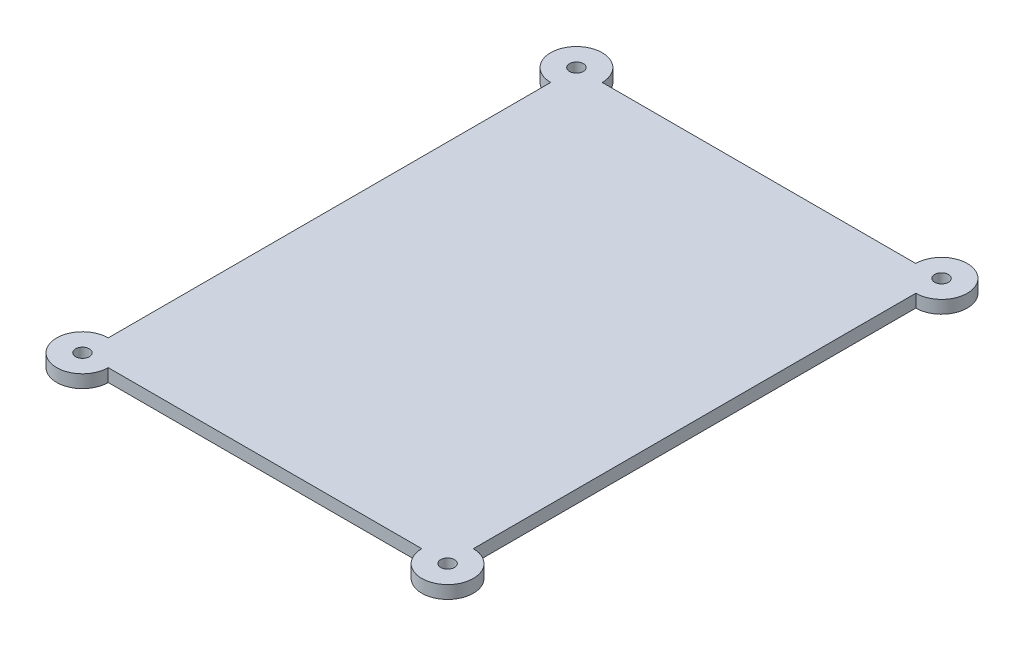
ISO-10303-21;
HEADER;
FILE_DESCRIPTION(('STEP AP214'),'2;1');
FILE_NAME('part.step','',(''),(''),'','','');
FILE_SCHEMA(('AUTOMOTIVE_DESIGN { 1 0 10303 214 1 1 1 1 }'));
ENDSEC;
DATA;
#1=APPLICATION_CONTEXT('core data for automotive mechanical design processes');
#2=APPLICATION_PROTOCOL_DEFINITION('international standard','automotive_design',2000,#1);
#3=PRODUCT_CONTEXT('',#1,'mechanical');
#4=PRODUCT('Part','Part','',(#3));
#5=PRODUCT_RELATED_PRODUCT_CATEGORY('part','',(#4));
#6=PRODUCT_DEFINITION_FORMATION('','',#4);
#7=PRODUCT_DEFINITION_CONTEXT('part definition',#1,'design');
#8=PRODUCT_DEFINITION('design','',#6,#7);
#9=PRODUCT_DEFINITION_SHAPE('','',#8);
#10=(LENGTH_UNIT() NAMED_UNIT(*) SI_UNIT(.MILLI.,.METRE.));
#11=(NAMED_UNIT(*) PLANE_ANGLE_UNIT() SI_UNIT($,.RADIAN.));
#12=(NAMED_UNIT(*) SI_UNIT($,.STERADIAN.) SOLID_ANGLE_UNIT());
#13=UNCERTAINTY_MEASURE_WITH_UNIT(LENGTH_MEASURE(1.E-05),#10,'distance_accuracy_value','');
#14=(GEOMETRIC_REPRESENTATION_CONTEXT(3) GLOBAL_UNCERTAINTY_ASSIGNED_CONTEXT((#13)) GLOBAL_UNIT_ASSIGNED_CONTEXT((#10,
#11,#12)) REPRESENTATION_CONTEXT('',''));
#15=CARTESIAN_POINT('',(0.,0.,0.));
#16=DIRECTION('',(0.,0.,1.));
#17=DIRECTION('',(1.,0.,0.));
#18=AXIS2_PLACEMENT_3D('',#15,#16,#17);
#19=CARTESIAN_POINT('',(-42.5,3.,57.5));
#20=DIRECTION('',(0.,-1.,0.));
#21=DIRECTION('',(0.,0.,-1.));
#22=AXIS2_PLACEMENT_3D('',#19,#20,#21);
#23=CYLINDRICAL_SURFACE('',#22,6.00000000000001);
#24=CARTESIAN_POINT('',(-42.5,0.,57.5));
#25=DIRECTION('',(0.,1.,0.));
#26=DIRECTION('',(0.,0.,1.));
#27=AXIS2_PLACEMENT_3D('',#24,#25,#26);
#28=CIRCLE('',#27,6.00000000000001);
#29=CARTESIAN_POINT('',(-42.5,0.,51.5));
#30=VERTEX_POINT('',#29);
#31=CARTESIAN_POINT('',(-36.5,0.,57.5));
#32=VERTEX_POINT('',#31);
#33=EDGE_CURVE('E145',#30,#32,#28,.T.);
#34=ORIENTED_EDGE('',*,*,#33,.T.);
#35=DIRECTION('',(0.,-1.,0.));
#36=VECTOR('',#35,1.);
#37=CARTESIAN_POINT('',(-36.5,3.,57.5));
#38=LINE('',#37,#36);
#39=CARTESIAN_POINT('',(-36.5,3.,57.5));
#40=VERTEX_POINT('',#39);
#41=EDGE_CURVE('E11',#40,#32,#38,.T.);
#42=ORIENTED_EDGE('',*,*,#41,.F.);
#43=CARTESIAN_POINT('',(-42.5,3.,57.5));
#44=DIRECTION('',(0.,1.,0.));
#45=DIRECTION('',(0.,0.,1.));
#46=AXIS2_PLACEMENT_3D('',#43,#44,#45);
#47=CIRCLE('',#46,6.00000000000001);
#48=CARTESIAN_POINT('',(-42.5,3.,51.5));
#49=VERTEX_POINT('',#48);
#50=EDGE_CURVE('E171',#49,#40,#47,.T.);
#51=ORIENTED_EDGE('',*,*,#50,.F.);
#52=DIRECTION('',(0.,-1.,0.));
#53=VECTOR('',#52,1.);
#54=CARTESIAN_POINT('',(-42.5,3.,51.5));
#55=LINE('',#54,#53);
#56=EDGE_CURVE('E58',#49,#30,#55,.T.);
#57=ORIENTED_EDGE('',*,*,#56,.T.);
#58=EDGE_LOOP('',(#34,#42,#51,#57));
#59=FACE_BOUND('',#58,.T.);
#60=ADVANCED_FACE('F41',(#59),#23,.T.);
#61=CARTESIAN_POINT('',(0.,3.,57.5));
#62=DIRECTION('',(0.,0.,-1.));
#63=DIRECTION('',(-1.,0.,0.));
#64=AXIS2_PLACEMENT_3D('',#61,#62,#63);
#65=PLANE('',#64);
#66=DIRECTION('',(1.,0.,0.));
#67=VECTOR('',#66,1.);
#68=CARTESIAN_POINT('',(0.,0.,57.5));
#69=LINE('',#68,#67);
#70=CARTESIAN_POINT('',(36.5,0.,57.5));
#71=VERTEX_POINT('',#70);
#72=EDGE_CURVE('E148',#32,#71,#69,.T.);
#73=ORIENTED_EDGE('',*,*,#72,.T.);
#74=DIRECTION('',(0.,-1.,0.));
#75=VECTOR('',#74,1.);
#76=CARTESIAN_POINT('',(36.5,3.,57.5));
#77=LINE('',#76,#75);
#78=CARTESIAN_POINT('',(36.5,3.,57.5));
#79=VERTEX_POINT('',#78);
#80=EDGE_CURVE('E50',#79,#71,#77,.T.);
#81=ORIENTED_EDGE('',*,*,#80,.F.);
#82=DIRECTION('',(1.,0.,0.));
#83=VECTOR('',#82,1.);
#84=CARTESIAN_POINT('',(0.,3.,57.5));
#85=LINE('',#84,#83);
#86=EDGE_CURVE('E97',#40,#79,#85,.T.);
#87=ORIENTED_EDGE('',*,*,#86,.F.);
#88=ORIENTED_EDGE('',*,*,#41,.T.);
#89=EDGE_LOOP('',(#73,#81,#87,#88));
#90=FACE_BOUND('',#89,.T.);
#91=ADVANCED_FACE('F215',(#90),#65,.F.);
#92=CARTESIAN_POINT('',(42.5,3.,57.5));
#93=DIRECTION('',(0.,-1.,0.));
#94=DIRECTION('',(0.,0.,-1.));
#95=AXIS2_PLACEMENT_3D('',#92,#93,#94);
#96=CYLINDRICAL_SURFACE('',#95,6.00000000000001);
#97=CARTESIAN_POINT('',(42.5,0.,57.5));
#98=DIRECTION('',(0.,1.,0.));
#99=DIRECTION('',(0.,0.,1.));
#100=AXIS2_PLACEMENT_3D('',#97,#98,#99);
#101=CIRCLE('',#100,6.00000000000001);
#102=CARTESIAN_POINT('',(42.5,0.,51.5));
#103=VERTEX_POINT('',#102);
#104=EDGE_CURVE('E152',#71,#103,#101,.T.);
#105=ORIENTED_EDGE('',*,*,#104,.T.);
#106=DIRECTION('',(0.,-1.,0.));
#107=VECTOR('',#106,1.);
#108=CARTESIAN_POINT('',(42.5,3.,51.5));
#109=LINE('',#108,#107);
#110=CARTESIAN_POINT('',(42.5,3.,51.5));
#111=VERTEX_POINT('',#110);
#112=EDGE_CURVE('E182',#111,#103,#109,.T.);
#113=ORIENTED_EDGE('',*,*,#112,.F.);
#114=CARTESIAN_POINT('',(42.5,3.,57.5));
#115=DIRECTION('',(0.,1.,0.));
#116=DIRECTION('',(0.,0.,1.));
#117=AXIS2_PLACEMENT_3D('',#114,#115,#116);
#118=CIRCLE('',#117,6.00000000000001);
#119=EDGE_CURVE('E192',#79,#111,#118,.T.);
#120=ORIENTED_EDGE('',*,*,#119,.F.);
#121=ORIENTED_EDGE('',*,*,#80,.T.);
#122=EDGE_LOOP('',(#105,#113,#120,#121));
#123=FACE_BOUND('',#122,.T.);
#124=ADVANCED_FACE('F190',(#123),#96,.T.);
#125=CARTESIAN_POINT('',(42.5,3.,0.));
#126=DIRECTION('',(-1.,0.,0.));
#127=DIRECTION('',(0.,0.,1.));
#128=AXIS2_PLACEMENT_3D('',#125,#126,#127);
#129=PLANE('',#128);
#130=DIRECTION('',(0.,0.,-1.));
#131=VECTOR('',#130,1.);
#132=CARTESIAN_POINT('',(42.5,0.,0.));
#133=LINE('',#132,#131);
#134=CARTESIAN_POINT('',(42.5,0.,-51.5));
#135=VERTEX_POINT('',#134);
#136=EDGE_CURVE('E155',#103,#135,#133,.T.);
#137=ORIENTED_EDGE('',*,*,#136,.T.);
#138=DIRECTION('',(0.,-1.,0.));
#139=VECTOR('',#138,1.);
#140=CARTESIAN_POINT('',(42.5,3.,-51.5));
#141=LINE('',#140,#139);
#142=CARTESIAN_POINT('',(42.5,3.,-51.5));
#143=VERTEX_POINT('',#142);
#144=EDGE_CURVE('E178',#143,#135,#141,.T.);
#145=ORIENTED_EDGE('',*,*,#144,.F.);
#146=DIRECTION('',(0.,0.,-1.));
#147=VECTOR('',#146,1.);
#148=CARTESIAN_POINT('',(42.5,3.,0.));
#149=LINE('',#148,#147);
#150=EDGE_CURVE('E139',#111,#143,#149,.T.);
#151=ORIENTED_EDGE('',*,*,#150,.F.);
#152=ORIENTED_EDGE('',*,*,#112,.T.);
#153=EDGE_LOOP('',(#137,#145,#151,#152));
#154=FACE_BOUND('',#153,.T.);
#155=ADVANCED_FACE('F199',(#154),#129,.F.);
#156=CARTESIAN_POINT('',(42.5,3.,-57.5));
#157=DIRECTION('',(0.,-1.,0.));
#158=DIRECTION('',(0.,0.,-1.));
#159=AXIS2_PLACEMENT_3D('',#156,#157,#158);
#160=CYLINDRICAL_SURFACE('',#159,6.00000000000001);
#161=CARTESIAN_POINT('',(42.5,0.,-57.5));
#162=DIRECTION('',(0.,1.,0.));
#163=DIRECTION('',(0.,0.,1.));
#164=AXIS2_PLACEMENT_3D('',#161,#162,#163);
#165=CIRCLE('',#164,6.00000000000001);
#166=CARTESIAN_POINT('',(36.5,0.,-57.5));
#167=VERTEX_POINT('',#166);
#168=EDGE_CURVE('E158',#135,#167,#165,.T.);
#169=ORIENTED_EDGE('',*,*,#168,.T.);
#170=DIRECTION('',(0.,-1.,0.));
#171=VECTOR('',#170,1.);
#172=CARTESIAN_POINT('',(36.5,3.,-57.5));
#173=LINE('',#172,#171);
#174=CARTESIAN_POINT('',(36.5,3.,-57.5));
#175=VERTEX_POINT('',#174);
#176=EDGE_CURVE('E123',#175,#167,#173,.T.);
#177=ORIENTED_EDGE('',*,*,#176,.F.);
#178=CARTESIAN_POINT('',(42.5,3.,-57.5));
#179=DIRECTION('',(0.,1.,0.));
#180=DIRECTION('',(0.,0.,1.));
#181=AXIS2_PLACEMENT_3D('',#178,#179,#180);
#182=CIRCLE('',#181,6.00000000000001);
#183=EDGE_CURVE('E134',#143,#175,#182,.T.);
#184=ORIENTED_EDGE('',*,*,#183,.F.);
#185=ORIENTED_EDGE('',*,*,#144,.T.);
#186=EDGE_LOOP('',(#169,#177,#184,#185));
#187=FACE_BOUND('',#186,.T.);
#188=ADVANCED_FACE('F202',(#187),#160,.T.);
#189=CARTESIAN_POINT('',(0.,3.,-57.5));
#190=DIRECTION('',(0.,0.,-1.));
#191=DIRECTION('',(-1.,0.,0.));
#192=AXIS2_PLACEMENT_3D('',#189,#190,#191);
#193=PLANE('',#192);
#194=DIRECTION('',(1.,0.,0.));
#195=VECTOR('',#194,1.);
#196=CARTESIAN_POINT('',(0.,0.,-57.5));
#197=LINE('',#196,#195);
#198=CARTESIAN_POINT('',(-36.5,0.,-57.5));
#199=VERTEX_POINT('',#198);
#200=EDGE_CURVE('E119',#199,#167,#197,.T.);
#201=ORIENTED_EDGE('',*,*,#200,.F.);
#202=DIRECTION('',(0.,-1.,0.));
#203=VECTOR('',#202,1.);
#204=CARTESIAN_POINT('',(-36.5,3.,-57.5));
#205=LINE('',#204,#203);
#206=CARTESIAN_POINT('',(-36.5,3.,-57.5));
#207=VERTEX_POINT('',#206);
#208=EDGE_CURVE('E113',#207,#199,#205,.T.);
#209=ORIENTED_EDGE('',*,*,#208,.F.);
#210=DIRECTION('',(1.,0.,0.));
#211=VECTOR('',#210,1.);
#212=CARTESIAN_POINT('',(0.,3.,-57.5));
#213=LINE('',#212,#211);
#214=EDGE_CURVE('E117',#207,#175,#213,.T.);
#215=ORIENTED_EDGE('',*,*,#214,.T.);
#216=ORIENTED_EDGE('',*,*,#176,.T.);
#217=EDGE_LOOP('',(#201,#209,#215,#216));
#218=FACE_BOUND('',#217,.T.);
#219=ADVANCED_FACE('F115',(#218),#193,.T.);
#220=CARTESIAN_POINT('',(-42.5,3.,-57.5));
#221=DIRECTION('',(0.,-1.,0.));
#222=DIRECTION('',(0.,0.,-1.));
#223=AXIS2_PLACEMENT_3D('',#220,#221,#222);
#224=CYLINDRICAL_SURFACE('',#223,6.00000000000001);
#225=CARTESIAN_POINT('',(-42.5,0.,-57.5));
#226=DIRECTION('',(0.,1.,0.));
#227=DIRECTION('',(0.,0.,1.));
#228=AXIS2_PLACEMENT_3D('',#225,#226,#227);
#229=CIRCLE('',#228,6.00000000000001);
#230=CARTESIAN_POINT('',(-42.5,0.,-51.5));
#231=VERTEX_POINT('',#230);
#232=EDGE_CURVE('E164',#199,#231,#229,.T.);
#233=ORIENTED_EDGE('',*,*,#232,.T.);
#234=DIRECTION('',(0.,-1.,0.));
#235=VECTOR('',#234,1.);
#236=CARTESIAN_POINT('',(-42.5,3.,-51.5));
#237=LINE('',#236,#235);
#238=CARTESIAN_POINT('',(-42.5,3.,-51.5));
#239=VERTEX_POINT('',#238);
#240=EDGE_CURVE('E85',#239,#231,#237,.T.);
#241=ORIENTED_EDGE('',*,*,#240,.F.);
#242=CARTESIAN_POINT('',(-42.5,3.,-57.5));
#243=DIRECTION('',(0.,1.,0.));
#244=DIRECTION('',(0.,0.,1.));
#245=AXIS2_PLACEMENT_3D('',#242,#243,#244);
#246=CIRCLE('',#245,6.00000000000001);
#247=EDGE_CURVE('E125',#207,#239,#246,.T.);
#248=ORIENTED_EDGE('',*,*,#247,.F.);
#249=ORIENTED_EDGE('',*,*,#208,.T.);
#250=EDGE_LOOP('',(#233,#241,#248,#249));
#251=FACE_BOUND('',#250,.T.);
#252=ADVANCED_FACE('F126',(#251),#224,.T.);
#253=CARTESIAN_POINT('',(-42.5,3.,0.));
#254=DIRECTION('',(-1.,0.,0.));
#255=DIRECTION('',(0.,0.,1.));
#256=AXIS2_PLACEMENT_3D('',#253,#254,#255);
#257=PLANE('',#256);
#258=DIRECTION('',(0.,0.,-1.));
#259=VECTOR('',#258,1.);
#260=CARTESIAN_POINT('',(-42.5,0.,0.));
#261=LINE('',#260,#259);
#262=EDGE_CURVE('E167',#30,#231,#261,.T.);
#263=ORIENTED_EDGE('',*,*,#262,.F.);
#264=ORIENTED_EDGE('',*,*,#56,.F.);
#265=DIRECTION('',(0.,0.,-1.));
#266=VECTOR('',#265,1.);
#267=CARTESIAN_POINT('',(-42.5,3.,0.));
#268=LINE('',#267,#266);
#269=EDGE_CURVE('E130',#49,#239,#268,.T.);
#270=ORIENTED_EDGE('',*,*,#269,.T.);
#271=ORIENTED_EDGE('',*,*,#240,.T.);
#272=EDGE_LOOP('',(#263,#264,#270,#271));
#273=FACE_BOUND('',#272,.T.);
#274=ADVANCED_FACE('F203',(#273),#257,.T.);
#275=CARTESIAN_POINT('',(0.,3.,0.));
#276=DIRECTION('',(0.,1.,0.));
#277=DIRECTION('',(0.,0.,1.));
#278=AXIS2_PLACEMENT_3D('',#275,#276,#277);
#279=PLANE('',#278);
#280=CARTESIAN_POINT('',(-42.5,3.,-57.5));
#281=DIRECTION('',(0.,1.,0.));
#282=DIRECTION('',(0.,0.,1.));
#283=AXIS2_PLACEMENT_3D('',#280,#281,#282);
#284=CIRCLE('',#283,1.6);
#285=CARTESIAN_POINT('',(-42.5,3.,-55.9));
#286=VERTEX_POINT('',#285);
#287=EDGE_CURVE('E149',#286,#286,#284,.T.);
#288=ORIENTED_EDGE('',*,*,#287,.F.);
#289=EDGE_LOOP('',(#288));
#290=FACE_BOUND('',#289,.T.);
#291=CARTESIAN_POINT('',(42.5,3.,-57.5));
#292=DIRECTION('',(0.,1.,0.));
#293=DIRECTION('',(0.,0.,1.));
#294=AXIS2_PLACEMENT_3D('',#291,#292,#293);
#295=CIRCLE('',#294,1.6);
#296=CARTESIAN_POINT('',(42.5,3.,-55.9));
#297=VERTEX_POINT('',#296);
#298=EDGE_CURVE('E231',#297,#297,#295,.T.);
#299=ORIENTED_EDGE('',*,*,#298,.F.);
#300=EDGE_LOOP('',(#299));
#301=FACE_BOUND('',#300,.T.);
#302=CARTESIAN_POINT('',(42.5,3.,57.5));
#303=DIRECTION('',(0.,1.,0.));
#304=DIRECTION('',(0.,0.,1.));
#305=AXIS2_PLACEMENT_3D('',#302,#303,#304);
#306=CIRCLE('',#305,1.6);
#307=CARTESIAN_POINT('',(42.5,3.,59.1));
#308=VERTEX_POINT('',#307);
#309=EDGE_CURVE('E235',#308,#308,#306,.T.);
#310=ORIENTED_EDGE('',*,*,#309,.F.);
#311=EDGE_LOOP('',(#310));
#312=FACE_BOUND('',#311,.T.);
#313=CARTESIAN_POINT('',(-42.5,3.,57.5));
#314=DIRECTION('',(0.,1.,0.));
#315=DIRECTION('',(0.,0.,1.));
#316=AXIS2_PLACEMENT_3D('',#313,#314,#315);
#317=CIRCLE('',#316,1.6);
#318=CARTESIAN_POINT('',(-42.5,3.,59.1));
#319=VERTEX_POINT('',#318);
#320=EDGE_CURVE('E239',#319,#319,#317,.T.);
#321=ORIENTED_EDGE('',*,*,#320,.F.);
#322=EDGE_LOOP('',(#321));
#323=FACE_BOUND('',#322,.T.);
#324=ORIENTED_EDGE('',*,*,#50,.T.);
#325=ORIENTED_EDGE('',*,*,#86,.T.);
#326=ORIENTED_EDGE('',*,*,#119,.T.);
#327=ORIENTED_EDGE('',*,*,#150,.T.);
#328=ORIENTED_EDGE('',*,*,#183,.T.);
#329=ORIENTED_EDGE('',*,*,#214,.F.);
#330=ORIENTED_EDGE('',*,*,#247,.T.);
#331=ORIENTED_EDGE('',*,*,#269,.F.);
#332=EDGE_LOOP('',(#324,#325,#326,#327,#328,#329,#330,#331));
#333=FACE_BOUND('',#332,.T.);
#334=ADVANCED_FACE('F132',(#290,#301,#312,#323,#333),#279,.T.);
#335=CARTESIAN_POINT('',(0.,0.,0.));
#336=DIRECTION('',(0.,1.,0.));
#337=DIRECTION('',(0.,0.,1.));
#338=AXIS2_PLACEMENT_3D('',#335,#336,#337);
#339=PLANE('',#338);
#340=CARTESIAN_POINT('',(-42.5,0.,-57.5));
#341=DIRECTION('',(0.,-1.,0.));
#342=DIRECTION('',(0.,0.,-1.));
#343=AXIS2_PLACEMENT_3D('',#340,#341,#342);
#344=CIRCLE('',#343,1.6);
#345=CARTESIAN_POINT('',(-42.5,0.,-59.1));
#346=VERTEX_POINT('',#345);
#347=EDGE_CURVE('E248',#346,#346,#344,.T.);
#348=ORIENTED_EDGE('',*,*,#347,.F.);
#349=EDGE_LOOP('',(#348));
#350=FACE_BOUND('',#349,.T.);
#351=CARTESIAN_POINT('',(42.5,0.,-57.5));
#352=DIRECTION('',(0.,-1.,0.));
#353=DIRECTION('',(0.,0.,-1.));
#354=AXIS2_PLACEMENT_3D('',#351,#352,#353);
#355=CIRCLE('',#354,1.6);
#356=CARTESIAN_POINT('',(42.5,0.,-59.1));
#357=VERTEX_POINT('',#356);
#358=EDGE_CURVE('E252',#357,#357,#355,.T.);
#359=ORIENTED_EDGE('',*,*,#358,.F.);
#360=EDGE_LOOP('',(#359));
#361=FACE_BOUND('',#360,.T.);
#362=CARTESIAN_POINT('',(42.5,0.,57.5));
#363=DIRECTION('',(0.,-1.,0.));
#364=DIRECTION('',(0.,0.,-1.));
#365=AXIS2_PLACEMENT_3D('',#362,#363,#364);
#366=CIRCLE('',#365,1.6);
#367=CARTESIAN_POINT('',(42.5,0.,55.9));
#368=VERTEX_POINT('',#367);
#369=EDGE_CURVE('E247',#368,#368,#366,.T.);
#370=ORIENTED_EDGE('',*,*,#369,.F.);
#371=EDGE_LOOP('',(#370));
#372=FACE_BOUND('',#371,.T.);
#373=CARTESIAN_POINT('',(-42.5,0.,57.5));
#374=DIRECTION('',(0.,-1.,0.));
#375=DIRECTION('',(0.,0.,-1.));
#376=AXIS2_PLACEMENT_3D('',#373,#374,#375);
#377=CIRCLE('',#376,1.6);
#378=CARTESIAN_POINT('',(-42.5,0.,55.9));
#379=VERTEX_POINT('',#378);
#380=EDGE_CURVE('E243',#379,#379,#377,.T.);
#381=ORIENTED_EDGE('',*,*,#380,.F.);
#382=EDGE_LOOP('',(#381));
#383=FACE_BOUND('',#382,.T.);
#384=ORIENTED_EDGE('',*,*,#33,.F.);
#385=ORIENTED_EDGE('',*,*,#262,.T.);
#386=ORIENTED_EDGE('',*,*,#232,.F.);
#387=ORIENTED_EDGE('',*,*,#200,.T.);
#388=ORIENTED_EDGE('',*,*,#168,.F.);
#389=ORIENTED_EDGE('',*,*,#136,.F.);
#390=ORIENTED_EDGE('',*,*,#104,.F.);
#391=ORIENTED_EDGE('',*,*,#72,.F.);
#392=EDGE_LOOP('',(#384,#385,#386,#387,#388,#389,#390,#391));
#393=FACE_BOUND('',#392,.T.);
#394=ADVANCED_FACE('F195',(#350,#361,#372,#383,#393),#339,.F.);
#395=CARTESIAN_POINT('',(-42.5,40.,57.5));
#396=DIRECTION('',(0.,-1.,0.));
#397=DIRECTION('',(0.,0.,-1.));
#398=AXIS2_PLACEMENT_3D('',#395,#396,#397);
#399=CYLINDRICAL_SURFACE('',#398,1.6);
#400=ORIENTED_EDGE('',*,*,#320,.T.);
#401=EDGE_LOOP('',(#400));
#402=FACE_BOUND('',#401,.T.);
#403=ORIENTED_EDGE('',*,*,#380,.T.);
#404=EDGE_LOOP('',(#403));
#405=FACE_BOUND('',#404,.T.);
#406=ADVANCED_FACE('F264',(#402,#405),#399,.F.);
#407=CARTESIAN_POINT('',(42.5,40.,57.5));
#408=DIRECTION('',(0.,-1.,0.));
#409=DIRECTION('',(0.,0.,-1.));
#410=AXIS2_PLACEMENT_3D('',#407,#408,#409);
#411=CYLINDRICAL_SURFACE('',#410,1.6);
#412=ORIENTED_EDGE('',*,*,#309,.T.);
#413=EDGE_LOOP('',(#412));
#414=FACE_BOUND('',#413,.T.);
#415=ORIENTED_EDGE('',*,*,#369,.T.);
#416=EDGE_LOOP('',(#415));
#417=FACE_BOUND('',#416,.T.);
#418=ADVANCED_FACE('F260',(#414,#417),#411,.F.);
#419=CARTESIAN_POINT('',(42.5,40.,-57.5));
#420=DIRECTION('',(0.,-1.,0.));
#421=DIRECTION('',(0.,0.,-1.));
#422=AXIS2_PLACEMENT_3D('',#419,#420,#421);
#423=CYLINDRICAL_SURFACE('',#422,1.6);
#424=ORIENTED_EDGE('',*,*,#298,.T.);
#425=EDGE_LOOP('',(#424));
#426=FACE_BOUND('',#425,.T.);
#427=ORIENTED_EDGE('',*,*,#358,.T.);
#428=EDGE_LOOP('',(#427));
#429=FACE_BOUND('',#428,.T.);
#430=ADVANCED_FACE('F274',(#426,#429),#423,.F.);
#431=CARTESIAN_POINT('',(-42.5,40.,-57.5));
#432=DIRECTION('',(0.,-1.,0.));
#433=DIRECTION('',(0.,0.,-1.));
#434=AXIS2_PLACEMENT_3D('',#431,#432,#433);
#435=CYLINDRICAL_SURFACE('',#434,1.6);
#436=ORIENTED_EDGE('',*,*,#287,.T.);
#437=EDGE_LOOP('',(#436));
#438=FACE_BOUND('',#437,.T.);
#439=ORIENTED_EDGE('',*,*,#347,.T.);
#440=EDGE_LOOP('',(#439));
#441=FACE_BOUND('',#440,.T.);
#442=ADVANCED_FACE('F278',(#438,#441),#435,.F.);
#443=CLOSED_SHELL('',(#60,#91,#124,#155,#188,#219,#252,#274,#334,#394,#406,#418,#430,#442));
#444=MANIFOLD_SOLID_BREP('B2',#443);
#445=ADVANCED_BREP_SHAPE_REPRESENTATION('',(#18,#444),#14);
#446=SHAPE_DEFINITION_REPRESENTATION(#9,#445);
ENDSEC;
END-ISO-10303-21;
